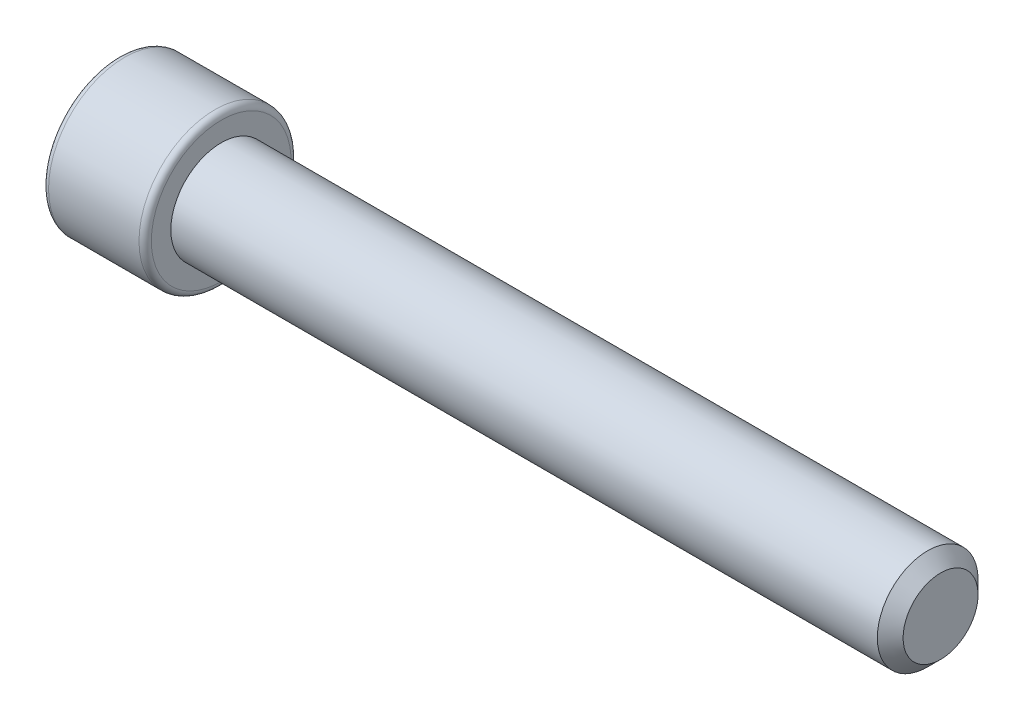
ISO-10303-21;
HEADER;
FILE_DESCRIPTION(('STEP AP214'),'2;1');
FILE_NAME('part.step','',(''),(''),'','','');
FILE_SCHEMA(('AUTOMOTIVE_DESIGN { 1 0 10303 214 1 1 1 1 }'));
ENDSEC;
DATA;
#1=APPLICATION_CONTEXT('core data for automotive mechanical design processes');
#2=APPLICATION_PROTOCOL_DEFINITION('international standard','automotive_design',2000,#1);
#3=PRODUCT_CONTEXT('',#1,'mechanical');
#4=PRODUCT('Part','Part','',(#3));
#5=PRODUCT_RELATED_PRODUCT_CATEGORY('part','',(#4));
#6=PRODUCT_DEFINITION_FORMATION('','',#4);
#7=PRODUCT_DEFINITION_CONTEXT('part definition',#1,'design');
#8=PRODUCT_DEFINITION('design','',#6,#7);
#9=PRODUCT_DEFINITION_SHAPE('','',#8);
#10=(LENGTH_UNIT() NAMED_UNIT(*) SI_UNIT(.MILLI.,.METRE.));
#11=(NAMED_UNIT(*) PLANE_ANGLE_UNIT() SI_UNIT($,.RADIAN.));
#12=(NAMED_UNIT(*) SI_UNIT($,.STERADIAN.) SOLID_ANGLE_UNIT());
#13=UNCERTAINTY_MEASURE_WITH_UNIT(LENGTH_MEASURE(1.E-05),#10,'distance_accuracy_value','');
#14=(GEOMETRIC_REPRESENTATION_CONTEXT(3) GLOBAL_UNCERTAINTY_ASSIGNED_CONTEXT((#13)) GLOBAL_UNIT_ASSIGNED_CONTEXT((#10,
#11,#12)) REPRESENTATION_CONTEXT('',''));
#15=CARTESIAN_POINT('',(0.,0.,0.));
#16=DIRECTION('',(0.,0.,1.));
#17=DIRECTION('',(1.,0.,0.));
#18=AXIS2_PLACEMENT_3D('',#15,#16,#17);
#19=CARTESIAN_POINT('',(25.4,0.,0.));
#20=DIRECTION('',(-1.,0.,0.));
#21=DIRECTION('',(0.,0.,1.));
#22=AXIS2_PLACEMENT_3D('',#19,#20,#21);
#23=PLANE('',#22);
#24=CARTESIAN_POINT('',(25.4,0.,0.));
#25=DIRECTION('',(-1.,0.,0.));
#26=DIRECTION('',(0.,0.,1.));
#27=AXIS2_PLACEMENT_3D('',#24,#25,#26);
#28=CIRCLE('',#27,2.31647999999999);
#29=CARTESIAN_POINT('',(25.4,0.,2.31647999999999));
#30=VERTEX_POINT('',#29);
#31=EDGE_CURVE('E11',#30,#30,#28,.F.);
#32=ORIENTED_EDGE('',*,*,#31,.T.);
#33=EDGE_LOOP('',(#32));
#34=FACE_BOUND('',#33,.T.);
#35=ADVANCED_FACE('F34',(#34),#23,.F.);
#36=CARTESIAN_POINT('',(-24.5047613380525,0.,0.));
#37=DIRECTION('',(-1.,0.,0.));
#38=DIRECTION('',(0.,0.,1.));
#39=AXIS2_PLACEMENT_3D('',#36,#37,#38);
#40=CYLINDRICAL_SURFACE('',#39,3.1115);
#41=CARTESIAN_POINT('',(24.60498,0.,0.));
#42=DIRECTION('',(-1.,0.,0.));
#43=DIRECTION('',(0.,0.,1.));
#44=AXIS2_PLACEMENT_3D('',#41,#42,#43);
#45=CIRCLE('',#44,3.1115);
#46=CARTESIAN_POINT('',(24.60498,0.,3.1115));
#47=VERTEX_POINT('',#46);
#48=EDGE_CURVE('E42',#47,#47,#45,.T.);
#49=ORIENTED_EDGE('',*,*,#48,.T.);
#50=EDGE_LOOP('',(#49));
#51=FACE_BOUND('',#50,.T.);
#52=CARTESIAN_POINT('',(-19.05,0.,0.));
#53=DIRECTION('',(-1.,0.,0.));
#54=DIRECTION('',(0.,0.,1.));
#55=AXIS2_PLACEMENT_3D('',#52,#53,#54);
#56=CIRCLE('',#55,3.11149999999999);
#57=CARTESIAN_POINT('',(-19.05,0.,3.11149999999999));
#58=VERTEX_POINT('',#57);
#59=EDGE_CURVE('E136',#58,#58,#56,.T.);
#60=ORIENTED_EDGE('',*,*,#59,.F.);
#61=EDGE_LOOP('',(#60));
#62=FACE_BOUND('',#61,.T.);
#63=ADVANCED_FACE('F158',(#51,#62),#40,.T.);
#64=CARTESIAN_POINT('',(-19.05,3.11149999999999,0.));
#65=DIRECTION('',(-1.,0.,0.));
#66=DIRECTION('',(0.,0.,1.));
#67=AXIS2_PLACEMENT_3D('',#64,#65,#66);
#68=PLANE('',#67);
#69=CARTESIAN_POINT('',(-19.05,0.,0.));
#70=DIRECTION('',(-1.,0.,0.));
#71=DIRECTION('',(0.,0.,1.));
#72=AXIS2_PLACEMENT_3D('',#69,#70,#71);
#73=CIRCLE('',#72,4.318);
#74=CARTESIAN_POINT('',(-19.05,0.,4.318));
#75=VERTEX_POINT('',#74);
#76=EDGE_CURVE('E150',#75,#75,#73,.F.);
#77=ORIENTED_EDGE('',*,*,#76,.T.);
#78=EDGE_LOOP('',(#77));
#79=FACE_BOUND('',#78,.T.);
#80=ORIENTED_EDGE('',*,*,#59,.T.);
#81=EDGE_LOOP('',(#80));
#82=FACE_BOUND('',#81,.T.);
#83=ADVANCED_FACE('F176',(#79,#82),#68,.F.);
#84=CARTESIAN_POINT('',(-24.5047613380525,0.,0.));
#85=DIRECTION('',(-1.,0.,0.));
#86=DIRECTION('',(0.,0.,1.));
#87=AXIS2_PLACEMENT_3D('',#84,#85,#86);
#88=CYLINDRICAL_SURFACE('',#87,4.699);
#89=CARTESIAN_POINT('',(-19.431,0.,0.));
#90=DIRECTION('',(-1.,0.,0.));
#91=DIRECTION('',(0.,0.,1.));
#92=AXIS2_PLACEMENT_3D('',#89,#90,#91);
#93=CIRCLE('',#92,4.699);
#94=CARTESIAN_POINT('',(-19.431,0.,4.699));
#95=VERTEX_POINT('',#94);
#96=EDGE_CURVE('E147',#95,#95,#93,.T.);
#97=ORIENTED_EDGE('',*,*,#96,.T.);
#98=EDGE_LOOP('',(#97));
#99=FACE_BOUND('',#98,.T.);
#100=CARTESIAN_POINT('',(-25.019,0.,0.));
#101=DIRECTION('',(1.,0.,0.));
#102=DIRECTION('',(0.,0.,-1.));
#103=AXIS2_PLACEMENT_3D('',#100,#101,#102);
#104=CIRCLE('',#103,4.699);
#105=CARTESIAN_POINT('',(-25.019,0.,-4.699));
#106=VERTEX_POINT('',#105);
#107=EDGE_CURVE('E144',#106,#106,#104,.T.);
#108=ORIENTED_EDGE('',*,*,#107,.T.);
#109=EDGE_LOOP('',(#108));
#110=FACE_BOUND('',#109,.T.);
#111=ADVANCED_FACE('F191',(#99,#110),#88,.T.);
#112=CARTESIAN_POINT('',(-25.4,4.699,0.));
#113=DIRECTION('',(1.,0.,0.));
#114=DIRECTION('',(0.,0.,-1.));
#115=AXIS2_PLACEMENT_3D('',#112,#113,#114);
#116=PLANE('',#115);
#117=CARTESIAN_POINT('',(-25.4,0.,0.));
#118=DIRECTION('',(1.,0.,0.));
#119=DIRECTION('',(0.,0.,-1.));
#120=AXIS2_PLACEMENT_3D('',#117,#118,#119);
#121=CIRCLE('',#120,4.318);
#122=CARTESIAN_POINT('',(-25.4,0.,-4.318));
#123=VERTEX_POINT('',#122);
#124=EDGE_CURVE('E153',#123,#123,#121,.F.);
#125=ORIENTED_EDGE('',*,*,#124,.T.);
#126=EDGE_LOOP('',(#125));
#127=FACE_BOUND('',#126,.T.);
#128=DIRECTION('',(0.,-0.5,-0.866025403784439));
#129=VECTOR('',#128,1.);
#130=CARTESIAN_POINT('',(-25.4,2.74963065701561,0.));
#131=LINE('',#130,#129);
#132=CARTESIAN_POINT('',(-25.4,2.74963065701561,0.));
#133=VERTEX_POINT('',#132);
#134=CARTESIAN_POINT('',(-25.4,1.37481532850786,-2.38124999999992));
#135=VERTEX_POINT('',#134);
#136=EDGE_CURVE('E123',#133,#135,#131,.T.);
#137=ORIENTED_EDGE('',*,*,#136,.F.);
#138=DIRECTION('',(0.,0.5,-0.866025403784439));
#139=VECTOR('',#138,1.);
#140=CARTESIAN_POINT('',(-25.4,1.37481532850786,2.38124999999992));
#141=LINE('',#140,#139);
#142=CARTESIAN_POINT('',(-25.4,1.37481532850786,2.38124999999992));
#143=VERTEX_POINT('',#142);
#144=EDGE_CURVE('E49',#143,#133,#141,.T.);
#145=ORIENTED_EDGE('',*,*,#144,.F.);
#146=DIRECTION('',(0.,1.,0.));
#147=VECTOR('',#146,1.);
#148=CARTESIAN_POINT('',(-25.4,-1.37481532850786,2.38124999999992));
#149=LINE('',#148,#147);
#150=CARTESIAN_POINT('',(-25.4,-1.37481532850786,2.38124999999992));
#151=VERTEX_POINT('',#150);
#152=EDGE_CURVE('E132',#151,#143,#149,.T.);
#153=ORIENTED_EDGE('',*,*,#152,.F.);
#154=DIRECTION('',(0.,0.5,0.866025403784439));
#155=VECTOR('',#154,1.);
#156=CARTESIAN_POINT('',(-25.4,-2.74963065701561,0.));
#157=LINE('',#156,#155);
#158=CARTESIAN_POINT('',(-25.4,-2.74963065701561,0.));
#159=VERTEX_POINT('',#158);
#160=EDGE_CURVE('E130',#159,#151,#157,.T.);
#161=ORIENTED_EDGE('',*,*,#160,.F.);
#162=DIRECTION('',(0.,-0.5,0.866025403784439));
#163=VECTOR('',#162,1.);
#164=CARTESIAN_POINT('',(-25.4,-1.37481532850786,-2.38124999999992));
#165=LINE('',#164,#163);
#166=CARTESIAN_POINT('',(-25.4,-1.37481532850786,-2.38124999999992));
#167=VERTEX_POINT('',#166);
#168=EDGE_CURVE('E97',#167,#159,#165,.T.);
#169=ORIENTED_EDGE('',*,*,#168,.F.);
#170=DIRECTION('',(0.,-1.,0.));
#171=VECTOR('',#170,1.);
#172=CARTESIAN_POINT('',(-25.4,1.37481532850786,-2.38124999999992));
#173=LINE('',#172,#171);
#174=EDGE_CURVE('E126',#135,#167,#173,.T.);
#175=ORIENTED_EDGE('',*,*,#174,.F.);
#176=EDGE_LOOP('',(#137,#145,#153,#161,#169,#175));
#177=FACE_BOUND('',#176,.T.);
#178=ADVANCED_FACE('F194',(#127,#177),#116,.F.);
#179=CARTESIAN_POINT('',(-21.59,1.37481532850786,2.38124999999992));
#180=DIRECTION('',(0.,0.866025403784439,0.5));
#181=DIRECTION('',(0.,-0.5,0.866025403784439));
#182=AXIS2_PLACEMENT_3D('',#179,#180,#181);
#183=PLANE('',#182);
#184=ORIENTED_EDGE('',*,*,#144,.T.);
#185=DIRECTION('',(-1.,0.,0.));
#186=VECTOR('',#185,1.);
#187=CARTESIAN_POINT('',(-21.59,2.74963065701561,0.));
#188=LINE('',#187,#186);
#189=CARTESIAN_POINT('',(-21.59,2.74963065701561,0.));
#190=VERTEX_POINT('',#189);
#191=EDGE_CURVE('E79',#190,#133,#188,.T.);
#192=ORIENTED_EDGE('',*,*,#191,.F.);
#193=DIRECTION('',(0.,0.5,-0.866025403784439));
#194=VECTOR('',#193,1.);
#195=CARTESIAN_POINT('',(-21.59,1.37481532850786,2.38124999999992));
#196=LINE('',#195,#194);
#197=CARTESIAN_POINT('',(-21.59,1.37481532850786,2.38124999999992));
#198=VERTEX_POINT('',#197);
#199=EDGE_CURVE('E134',#198,#190,#196,.T.);
#200=ORIENTED_EDGE('',*,*,#199,.F.);
#201=DIRECTION('',(-1.,0.,0.));
#202=VECTOR('',#201,1.);
#203=CARTESIAN_POINT('',(-21.59,1.37481532850786,2.38124999999992));
#204=LINE('',#203,#202);
#205=EDGE_CURVE('E57',#198,#143,#204,.T.);
#206=ORIENTED_EDGE('',*,*,#205,.T.);
#207=EDGE_LOOP('',(#184,#192,#200,#206));
#208=FACE_BOUND('',#207,.T.);
#209=ADVANCED_FACE('F202',(#208),#183,.F.);
#210=CARTESIAN_POINT('',(-21.59,-1.37481532850786,2.38124999999992));
#211=DIRECTION('',(0.,0.,1.));
#212=DIRECTION('',(1.,0.,0.));
#213=AXIS2_PLACEMENT_3D('',#210,#211,#212);
#214=PLANE('',#213);
#215=ORIENTED_EDGE('',*,*,#152,.T.);
#216=ORIENTED_EDGE('',*,*,#205,.F.);
#217=DIRECTION('',(0.,1.,0.));
#218=VECTOR('',#217,1.);
#219=CARTESIAN_POINT('',(-21.59,-1.37481532850786,2.38124999999992));
#220=LINE('',#219,#218);
#221=CARTESIAN_POINT('',(-21.59,-1.37481532850786,2.38124999999992));
#222=VERTEX_POINT('',#221);
#223=EDGE_CURVE('E109',#222,#198,#220,.T.);
#224=ORIENTED_EDGE('',*,*,#223,.F.);
#225=DIRECTION('',(-1.,0.,0.));
#226=VECTOR('',#225,1.);
#227=CARTESIAN_POINT('',(-21.59,-1.37481532850786,2.38124999999992));
#228=LINE('',#227,#226);
#229=EDGE_CURVE('E101',#222,#151,#228,.T.);
#230=ORIENTED_EDGE('',*,*,#229,.T.);
#231=EDGE_LOOP('',(#215,#216,#224,#230));
#232=FACE_BOUND('',#231,.T.);
#233=ADVANCED_FACE('F210',(#232),#214,.F.);
#234=CARTESIAN_POINT('',(-21.59,-2.74963065701561,0.));
#235=DIRECTION('',(0.,-0.866025403784439,0.5));
#236=DIRECTION('',(0.,-0.5,-0.866025403784439));
#237=AXIS2_PLACEMENT_3D('',#234,#235,#236);
#238=PLANE('',#237);
#239=ORIENTED_EDGE('',*,*,#160,.T.);
#240=ORIENTED_EDGE('',*,*,#229,.F.);
#241=DIRECTION('',(0.,0.5,0.866025403784439));
#242=VECTOR('',#241,1.);
#243=CARTESIAN_POINT('',(-21.59,-2.74963065701561,0.));
#244=LINE('',#243,#242);
#245=CARTESIAN_POINT('',(-21.59,-2.74963065701561,0.));
#246=VERTEX_POINT('',#245);
#247=EDGE_CURVE('E105',#246,#222,#244,.T.);
#248=ORIENTED_EDGE('',*,*,#247,.F.);
#249=DIRECTION('',(-1.,0.,0.));
#250=VECTOR('',#249,1.);
#251=CARTESIAN_POINT('',(-21.59,-2.74963065701561,0.));
#252=LINE('',#251,#250);
#253=EDGE_CURVE('E90',#246,#159,#252,.T.);
#254=ORIENTED_EDGE('',*,*,#253,.T.);
#255=EDGE_LOOP('',(#239,#240,#248,#254));
#256=FACE_BOUND('',#255,.T.);
#257=ADVANCED_FACE('F106',(#256),#238,.F.);
#258=CARTESIAN_POINT('',(-21.59,-1.37481532850786,-2.38124999999992));
#259=DIRECTION('',(0.,-0.866025403784439,-0.5));
#260=DIRECTION('',(0.,0.5,-0.866025403784439));
#261=AXIS2_PLACEMENT_3D('',#258,#259,#260);
#262=PLANE('',#261);
#263=ORIENTED_EDGE('',*,*,#168,.T.);
#264=ORIENTED_EDGE('',*,*,#253,.F.);
#265=DIRECTION('',(0.,-0.5,0.866025403784439));
#266=VECTOR('',#265,1.);
#267=CARTESIAN_POINT('',(-21.59,-1.37481532850786,-2.38124999999992));
#268=LINE('',#267,#266);
#269=CARTESIAN_POINT('',(-21.59,-1.37481532850786,-2.38124999999992));
#270=VERTEX_POINT('',#269);
#271=EDGE_CURVE('E94',#270,#246,#268,.T.);
#272=ORIENTED_EDGE('',*,*,#271,.F.);
#273=DIRECTION('',(-1.,0.,0.));
#274=VECTOR('',#273,1.);
#275=CARTESIAN_POINT('',(-21.59,-1.37481532850786,-2.38124999999992));
#276=LINE('',#275,#274);
#277=EDGE_CURVE('E102',#270,#167,#276,.T.);
#278=ORIENTED_EDGE('',*,*,#277,.T.);
#279=EDGE_LOOP('',(#263,#264,#272,#278));
#280=FACE_BOUND('',#279,.T.);
#281=ADVANCED_FACE('F92',(#280),#262,.F.);
#282=CARTESIAN_POINT('',(-21.59,1.37481532850786,-2.38124999999992));
#283=DIRECTION('',(0.,0.,-1.));
#284=DIRECTION('',(-1.,0.,0.));
#285=AXIS2_PLACEMENT_3D('',#282,#283,#284);
#286=PLANE('',#285);
#287=ORIENTED_EDGE('',*,*,#174,.T.);
#288=ORIENTED_EDGE('',*,*,#277,.F.);
#289=DIRECTION('',(0.,-1.,0.));
#290=VECTOR('',#289,1.);
#291=CARTESIAN_POINT('',(-21.59,1.37481532850786,-2.38124999999992));
#292=LINE('',#291,#290);
#293=CARTESIAN_POINT('',(-21.59,1.37481532850786,-2.38124999999992));
#294=VERTEX_POINT('',#293);
#295=EDGE_CURVE('E115',#294,#270,#292,.T.);
#296=ORIENTED_EDGE('',*,*,#295,.F.);
#297=DIRECTION('',(-1.,0.,0.));
#298=VECTOR('',#297,1.);
#299=CARTESIAN_POINT('',(-21.59,1.37481532850786,-2.38124999999992));
#300=LINE('',#299,#298);
#301=EDGE_CURVE('E139',#294,#135,#300,.T.);
#302=ORIENTED_EDGE('',*,*,#301,.T.);
#303=EDGE_LOOP('',(#287,#288,#296,#302));
#304=FACE_BOUND('',#303,.T.);
#305=ADVANCED_FACE('F276',(#304),#286,.F.);
#306=CARTESIAN_POINT('',(-21.59,2.74963065701561,0.));
#307=DIRECTION('',(0.,0.866025403784439,-0.5));
#308=DIRECTION('',(0.,0.5,0.866025403784439));
#309=AXIS2_PLACEMENT_3D('',#306,#307,#308);
#310=PLANE('',#309);
#311=ORIENTED_EDGE('',*,*,#136,.T.);
#312=ORIENTED_EDGE('',*,*,#301,.F.);
#313=DIRECTION('',(0.,-0.5,-0.866025403784439));
#314=VECTOR('',#313,1.);
#315=CARTESIAN_POINT('',(-21.59,2.74963065701561,0.));
#316=LINE('',#315,#314);
#317=EDGE_CURVE('E117',#190,#294,#316,.T.);
#318=ORIENTED_EDGE('',*,*,#317,.F.);
#319=ORIENTED_EDGE('',*,*,#191,.T.);
#320=EDGE_LOOP('',(#311,#312,#318,#319));
#321=FACE_BOUND('',#320,.T.);
#322=ADVANCED_FACE('F185',(#321),#310,.F.);
#323=CARTESIAN_POINT('',(-21.59,2.74963065701561,0.));
#324=DIRECTION('',(-1.,0.,0.));
#325=DIRECTION('',(0.,0.,1.));
#326=AXIS2_PLACEMENT_3D('',#323,#324,#325);
#327=PLANE('',#326);
#328=ORIENTED_EDGE('',*,*,#199,.T.);
#329=ORIENTED_EDGE('',*,*,#317,.T.);
#330=ORIENTED_EDGE('',*,*,#295,.T.);
#331=ORIENTED_EDGE('',*,*,#271,.T.);
#332=ORIENTED_EDGE('',*,*,#247,.T.);
#333=ORIENTED_EDGE('',*,*,#223,.T.);
#334=EDGE_LOOP('',(#328,#329,#330,#331,#332,#333));
#335=FACE_BOUND('',#334,.T.);
#336=ADVANCED_FACE('F112',(#335),#327,.T.);
#337=CARTESIAN_POINT('',(-19.431,0.,0.));
#338=DIRECTION('',(-1.,0.,0.));
#339=DIRECTION('',(0.,0.,1.));
#340=AXIS2_PLACEMENT_3D('',#337,#338,#339);
#341=TOROIDAL_SURFACE('',#340,4.318,0.381);
#342=ORIENTED_EDGE('',*,*,#76,.F.);
#343=EDGE_LOOP('',(#342));
#344=FACE_BOUND('',#343,.T.);
#345=ORIENTED_EDGE('',*,*,#96,.F.);
#346=EDGE_LOOP('',(#345));
#347=FACE_BOUND('',#346,.T.);
#348=ADVANCED_FACE('F167',(#344,#347),#341,.T.);
#349=CARTESIAN_POINT('',(-25.019,0.,0.));
#350=DIRECTION('',(1.,0.,0.));
#351=DIRECTION('',(0.,0.,-1.));
#352=AXIS2_PLACEMENT_3D('',#349,#350,#351);
#353=TOROIDAL_SURFACE('',#352,4.318,0.381);
#354=ORIENTED_EDGE('',*,*,#107,.F.);
#355=EDGE_LOOP('',(#354));
#356=FACE_BOUND('',#355,.T.);
#357=ORIENTED_EDGE('',*,*,#124,.F.);
#358=EDGE_LOOP('',(#357));
#359=FACE_BOUND('',#358,.T.);
#360=ADVANCED_FACE('F162',(#356,#359),#353,.T.);
#361=CARTESIAN_POINT('',(24.60498,0.,0.));
#362=DIRECTION('',(-1.,0.,0.));
#363=DIRECTION('',(0.,0.,1.));
#364=AXIS2_PLACEMENT_3D('',#361,#362,#363);
#365=CONICAL_SURFACE('',#364,3.1115,0.785398163397454);
#366=ORIENTED_EDGE('',*,*,#31,.F.);
#367=EDGE_LOOP('',(#366));
#368=FACE_BOUND('',#367,.T.);
#369=ORIENTED_EDGE('',*,*,#48,.F.);
#370=EDGE_LOOP('',(#369));
#371=FACE_BOUND('',#370,.T.);
#372=ADVANCED_FACE('F36',(#368,#371),#365,.T.);
#373=CLOSED_SHELL('',(#35,#63,#83,#111,#178,#209,#233,#257,#281,#305,#322,#336,#348,#360,#372));
#374=MANIFOLD_SOLID_BREP('B2',#373);
#375=ADVANCED_BREP_SHAPE_REPRESENTATION('',(#18,#374),#14);
#376=SHAPE_DEFINITION_REPRESENTATION(#9,#375);
ENDSEC;
END-ISO-10303-21;
